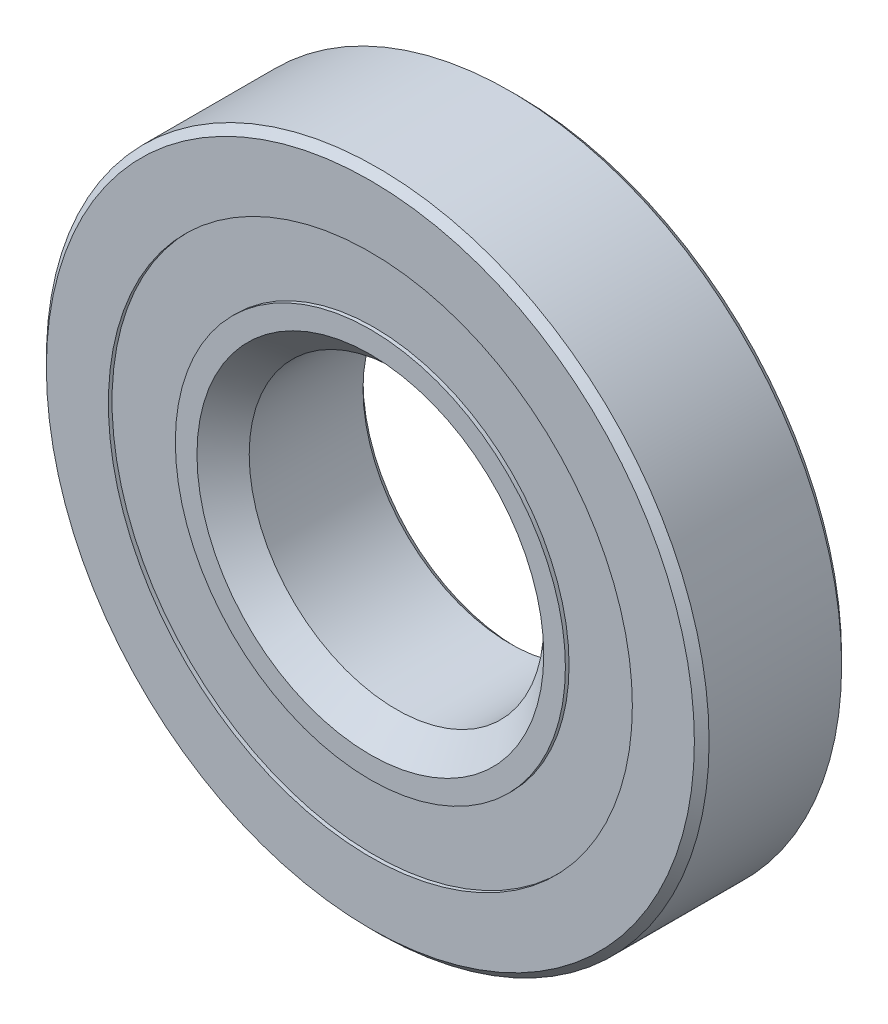
ISO-10303-21;
HEADER;
FILE_DESCRIPTION(('STEP AP214'),'2;1');
FILE_NAME('part.step','',(''),(''),'','','');
FILE_SCHEMA(('AUTOMOTIVE_DESIGN { 1 0 10303 214 1 1 1 1 }'));
ENDSEC;
DATA;
#1=APPLICATION_CONTEXT('core data for automotive mechanical design processes');
#2=APPLICATION_PROTOCOL_DEFINITION('international standard','automotive_design',2000,#1);
#3=PRODUCT_CONTEXT('',#1,'mechanical');
#4=PRODUCT('Part','Part','',(#3));
#5=PRODUCT_RELATED_PRODUCT_CATEGORY('part','',(#4));
#6=PRODUCT_DEFINITION_FORMATION('','',#4);
#7=PRODUCT_DEFINITION_CONTEXT('part definition',#1,'design');
#8=PRODUCT_DEFINITION('design','',#6,#7);
#9=PRODUCT_DEFINITION_SHAPE('','',#8);
#10=(LENGTH_UNIT() NAMED_UNIT(*) SI_UNIT(.MILLI.,.METRE.));
#11=(NAMED_UNIT(*) PLANE_ANGLE_UNIT() SI_UNIT($,.RADIAN.));
#12=(NAMED_UNIT(*) SI_UNIT($,.STERADIAN.) SOLID_ANGLE_UNIT());
#13=UNCERTAINTY_MEASURE_WITH_UNIT(LENGTH_MEASURE(1.E-05),#10,'distance_accuracy_value','');
#14=(GEOMETRIC_REPRESENTATION_CONTEXT(3) GLOBAL_UNCERTAINTY_ASSIGNED_CONTEXT((#13)) GLOBAL_UNIT_ASSIGNED_CONTEXT((#10,
#11,#12)) REPRESENTATION_CONTEXT('',''));
#15=CARTESIAN_POINT('',(0.,0.,0.));
#16=DIRECTION('',(0.,0.,1.));
#17=DIRECTION('',(1.,0.,0.));
#18=AXIS2_PLACEMENT_3D('',#15,#16,#17);
#19=CARTESIAN_POINT('',(0.,11.2956730769231,-3.01625));
#20=DIRECTION('',(0.,0.,1.));
#21=DIRECTION('',(1.,0.,0.));
#22=AXIS2_PLACEMENT_3D('',#19,#20,#21);
#23=PLANE('',#22);
#24=CARTESIAN_POINT('',(0.,0.,-3.01625));
#25=DIRECTION('',(0.,0.,1.));
#26=DIRECTION('',(1.,0.,0.));
#27=AXIS2_PLACEMENT_3D('',#24,#25,#26);
#28=CIRCLE('',#27,11.2956730769231);
#29=CARTESIAN_POINT('',(11.2956730769231,0.,-3.01625));
#30=VERTEX_POINT('',#29);
#31=EDGE_CURVE('E57',#30,#30,#28,.T.);
#32=ORIENTED_EDGE('',*,*,#31,.F.);
#33=EDGE_LOOP('',(#32));
#34=FACE_BOUND('',#33,.T.);
#35=CARTESIAN_POINT('',(0.,0.,-3.01625));
#36=DIRECTION('',(0.,0.,1.));
#37=DIRECTION('',(1.,0.,0.));
#38=AXIS2_PLACEMENT_3D('',#35,#36,#37);
#39=CIRCLE('',#38,8.40903123628057);
#40=CARTESIAN_POINT('',(8.40903123628057,0.,-3.01625));
#41=VERTEX_POINT('',#40);
#42=EDGE_CURVE('E11',#41,#41,#39,.T.);
#43=ORIENTED_EDGE('',*,*,#42,.T.);
#44=EDGE_LOOP('',(#43));
#45=FACE_BOUND('',#44,.T.);
#46=ADVANCED_FACE('F43',(#34,#45),#23,.F.);
#47=CARTESIAN_POINT('',(0.,0.,3.175));
#48=DIRECTION('',(0.,0.,1.));
#49=DIRECTION('',(1.,0.,0.));
#50=AXIS2_PLACEMENT_3D('',#47,#48,#49);
#51=CYLINDRICAL_SURFACE('',#50,8.40903123628057);
#52=ORIENTED_EDGE('',*,*,#42,.F.);
#53=EDGE_LOOP('',(#52));
#54=FACE_BOUND('',#53,.T.);
#55=CARTESIAN_POINT('',(0.,0.,-1.71627890103155));
#56=DIRECTION('',(0.,0.,1.));
#57=DIRECTION('',(1.,0.,0.));
#58=AXIS2_PLACEMENT_3D('',#55,#56,#57);
#59=CIRCLE('',#58,8.40903123628057);
#60=CARTESIAN_POINT('',(8.40903123628057,0.,-1.71627890103155));
#61=VERTEX_POINT('',#60);
#62=EDGE_CURVE('E49',#61,#61,#59,.T.);
#63=ORIENTED_EDGE('',*,*,#62,.T.);
#64=EDGE_LOOP('',(#63));
#65=FACE_BOUND('',#64,.T.);
#66=ADVANCED_FACE('F66',(#54,#65),#51,.F.);
#67=CARTESIAN_POINT('',(0.,11.2956730769231,-1.71627890103155));
#68=DIRECTION('',(0.,0.,-1.));
#69=DIRECTION('',(-1.,0.,0.));
#70=AXIS2_PLACEMENT_3D('',#67,#68,#69);
#71=PLANE('',#70);
#72=ORIENTED_EDGE('',*,*,#62,.F.);
#73=EDGE_LOOP('',(#72));
#74=FACE_BOUND('',#73,.T.);
#75=CARTESIAN_POINT('',(0.,0.,-1.71627890103155));
#76=DIRECTION('',(0.,0.,1.));
#77=DIRECTION('',(1.,0.,0.));
#78=AXIS2_PLACEMENT_3D('',#75,#76,#77);
#79=CIRCLE('',#78,11.2956730769231);
#80=CARTESIAN_POINT('',(11.2956730769231,0.,-1.71627890103155));
#81=VERTEX_POINT('',#80);
#82=EDGE_CURVE('E53',#81,#81,#79,.T.);
#83=ORIENTED_EDGE('',*,*,#82,.T.);
#84=EDGE_LOOP('',(#83));
#85=FACE_BOUND('',#84,.T.);
#86=ADVANCED_FACE('F70',(#74,#85),#71,.F.);
#87=CARTESIAN_POINT('',(0.,0.,3.175));
#88=DIRECTION('',(0.,0.,1.));
#89=DIRECTION('',(1.,0.,0.));
#90=AXIS2_PLACEMENT_3D('',#87,#88,#89);
#91=CYLINDRICAL_SURFACE('',#90,11.2956730769231);
#92=ORIENTED_EDGE('',*,*,#82,.F.);
#93=EDGE_LOOP('',(#92));
#94=FACE_BOUND('',#93,.T.);
#95=ORIENTED_EDGE('',*,*,#31,.T.);
#96=EDGE_LOOP('',(#95));
#97=FACE_BOUND('',#96,.T.);
#98=ADVANCED_FACE('F63',(#94,#97),#91,.T.);
#99=CLOSED_SHELL('',(#46,#66,#86,#98));
#100=MANIFOLD_SOLID_BREP('B2',#99);
#101=CARTESIAN_POINT('',(0.,11.2956730769231,3.01625));
#102=DIRECTION('',(0.,0.,-1.));
#103=DIRECTION('',(-1.,0.,0.));
#104=AXIS2_PLACEMENT_3D('',#101,#102,#103);
#105=PLANE('',#104);
#106=CARTESIAN_POINT('',(0.,0.,3.01625));
#107=DIRECTION('',(0.,0.,1.));
#108=DIRECTION('',(1.,0.,0.));
#109=AXIS2_PLACEMENT_3D('',#106,#107,#108);
#110=CIRCLE('',#109,8.40903123628057);
#111=CARTESIAN_POINT('',(8.40903123628057,0.,3.01625));
#112=VERTEX_POINT('',#111);
#113=EDGE_CURVE('E42',#112,#112,#110,.T.);
#114=ORIENTED_EDGE('',*,*,#113,.F.);
#115=EDGE_LOOP('',(#114));
#116=FACE_BOUND('',#115,.T.);
#117=CARTESIAN_POINT('',(0.,0.,3.01625));
#118=DIRECTION('',(0.,0.,1.));
#119=DIRECTION('',(1.,0.,0.));
#120=AXIS2_PLACEMENT_3D('',#117,#118,#119);
#121=CIRCLE('',#120,11.2956730769231);
#122=CARTESIAN_POINT('',(11.2956730769231,0.,3.01625));
#123=VERTEX_POINT('',#122);
#124=EDGE_CURVE('E124',#123,#123,#121,.T.);
#125=ORIENTED_EDGE('',*,*,#124,.T.);
#126=EDGE_LOOP('',(#125));
#127=FACE_BOUND('',#126,.T.);
#128=ADVANCED_FACE('F110',(#116,#127),#105,.F.);
#129=CARTESIAN_POINT('',(0.,0.,3.175));
#130=DIRECTION('',(0.,0.,1.));
#131=DIRECTION('',(1.,0.,0.));
#132=AXIS2_PLACEMENT_3D('',#129,#130,#131);
#133=CYLINDRICAL_SURFACE('',#132,8.40903123628057);
#134=CARTESIAN_POINT('',(0.,0.,1.71627890103156));
#135=DIRECTION('',(0.,0.,1.));
#136=DIRECTION('',(1.,0.,0.));
#137=AXIS2_PLACEMENT_3D('',#134,#135,#136);
#138=CIRCLE('',#137,8.40903123628057);
#139=CARTESIAN_POINT('',(8.40903123628057,0.,1.71627890103156));
#140=VERTEX_POINT('',#139);
#141=EDGE_CURVE('E116',#140,#140,#138,.T.);
#142=ORIENTED_EDGE('',*,*,#141,.F.);
#143=EDGE_LOOP('',(#142));
#144=FACE_BOUND('',#143,.T.);
#145=ORIENTED_EDGE('',*,*,#113,.T.);
#146=EDGE_LOOP('',(#145));
#147=FACE_BOUND('',#146,.T.);
#148=ADVANCED_FACE('F139',(#144,#147),#133,.F.);
#149=CARTESIAN_POINT('',(0.,11.2956730769231,1.71627890103156));
#150=DIRECTION('',(0.,0.,1.));
#151=DIRECTION('',(1.,0.,0.));
#152=AXIS2_PLACEMENT_3D('',#149,#150,#151);
#153=PLANE('',#152);
#154=CARTESIAN_POINT('',(0.,0.,1.71627890103156));
#155=DIRECTION('',(0.,0.,1.));
#156=DIRECTION('',(1.,0.,0.));
#157=AXIS2_PLACEMENT_3D('',#154,#155,#156);
#158=CIRCLE('',#157,11.2956730769231);
#159=CARTESIAN_POINT('',(11.2956730769231,0.,1.71627890103156));
#160=VERTEX_POINT('',#159);
#161=EDGE_CURVE('E120',#160,#160,#158,.T.);
#162=ORIENTED_EDGE('',*,*,#161,.F.);
#163=EDGE_LOOP('',(#162));
#164=FACE_BOUND('',#163,.T.);
#165=ORIENTED_EDGE('',*,*,#141,.T.);
#166=EDGE_LOOP('',(#165));
#167=FACE_BOUND('',#166,.T.);
#168=ADVANCED_FACE('F134',(#164,#167),#153,.F.);
#169=CARTESIAN_POINT('',(0.,0.,3.175));
#170=DIRECTION('',(0.,0.,1.));
#171=DIRECTION('',(1.,0.,0.));
#172=AXIS2_PLACEMENT_3D('',#169,#170,#171);
#173=CYLINDRICAL_SURFACE('',#172,11.2956730769231);
#174=ORIENTED_EDGE('',*,*,#124,.F.);
#175=EDGE_LOOP('',(#174));
#176=FACE_BOUND('',#175,.T.);
#177=ORIENTED_EDGE('',*,*,#161,.T.);
#178=EDGE_LOOP('',(#177));
#179=FACE_BOUND('',#178,.T.);
#180=ADVANCED_FACE('F131',(#176,#179),#173,.T.);
#181=CLOSED_SHELL('',(#128,#148,#168,#180));
#182=MANIFOLD_SOLID_BREP('B6',#181);
#183=CARTESIAN_POINT('',(-5.15937499999989,8.93629963530074,0.));
#184=DIRECTION('',(0.,0.,1.));
#185=DIRECTION('',(-0.499999999999989,0.866025403784445,0.));
#186=AXIS2_PLACEMENT_3D('',#183,#184,#185);
#187=SPHERICAL_SURFACE('',#186,1.71627890103156);
#188=CARTESIAN_POINT('',(-5.15937499999989,8.93629963530074,1.71627890103156));
#189=VERTEX_POINT('',#188);
#190=VERTEX_LOOP('',#189);
#191=FACE_BOUND('',#190,.T.);
#192=ADVANCED_FACE('F192',(#191),#187,.T.);
#193=CLOSED_SHELL('',(#192));
#194=MANIFOLD_SOLID_BREP('B37',#193);
#195=CARTESIAN_POINT('',(-8.93629963530062,5.1593750000001,0.));
#196=DIRECTION('',(0.,0.,1.));
#197=DIRECTION('',(-0.866025403784433,0.50000000000001,0.));
#198=AXIS2_PLACEMENT_3D('',#195,#196,#197);
#199=SPHERICAL_SURFACE('',#198,1.71627890103156);
#200=CARTESIAN_POINT('',(-8.93629963530062,5.1593750000001,1.71627890103156));
#201=VERTEX_POINT('',#200);
#202=VERTEX_LOOP('',#201);
#203=FACE_BOUND('',#202,.T.);
#204=ADVANCED_FACE('F225',(#203),#199,.T.);
#205=CLOSED_SHELL('',(#204));
#206=MANIFOLD_SOLID_BREP('B106',#205);
#207=CARTESIAN_POINT('',(-10.31875,1.08083169195563E-13,0.));
#208=DIRECTION('',(0.,0.,1.));
#209=DIRECTION('',(-1.,0.,0.));
#210=AXIS2_PLACEMENT_3D('',#207,#208,#209);
#211=SPHERICAL_SURFACE('',#210,1.71627890103156);
#212=CARTESIAN_POINT('',(-10.31875,1.08083169195563E-13,1.71627890103156));
#213=VERTEX_POINT('',#212);
#214=VERTEX_LOOP('',#213);
#215=FACE_BOUND('',#214,.T.);
#216=ADVANCED_FACE('F256',(#215),#211,.T.);
#217=CLOSED_SHELL('',(#216));
#218=MANIFOLD_SOLID_BREP('B188',#217);
#219=CARTESIAN_POINT('',(-8.93629963530072,-5.15937499999992,0.));
#220=DIRECTION('',(0.,0.,1.));
#221=DIRECTION('',(-0.866025403784443,-0.499999999999992,0.));
#222=AXIS2_PLACEMENT_3D('',#219,#220,#221);
#223=SPHERICAL_SURFACE('',#222,1.71627890103156);
#224=CARTESIAN_POINT('',(-8.93629963530072,-5.15937499999992,1.71627890103156));
#225=VERTEX_POINT('',#224);
#226=VERTEX_LOOP('',#225);
#227=FACE_BOUND('',#226,.T.);
#228=ADVANCED_FACE('F287',(#227),#223,.T.);
#229=CLOSED_SHELL('',(#228));
#230=MANIFOLD_SOLID_BREP('B221',#229);
#231=CARTESIAN_POINT('',(-5.15937500000007,-8.93629963530064,0.));
#232=DIRECTION('',(0.,0.,1.));
#233=DIRECTION('',(-0.500000000000007,-0.866025403784435,0.));
#234=AXIS2_PLACEMENT_3D('',#231,#232,#233);
#235=SPHERICAL_SURFACE('',#234,1.71627890103156);
#236=CARTESIAN_POINT('',(-5.15937500000007,-8.93629963530064,1.71627890103156));
#237=VERTEX_POINT('',#236);
#238=VERTEX_LOOP('',#237);
#239=FACE_BOUND('',#238,.T.);
#240=ADVANCED_FACE('F318',(#239),#235,.T.);
#241=CLOSED_SHELL('',(#240));
#242=MANIFOLD_SOLID_BREP('B252',#241);
#243=CARTESIAN_POINT('',(0.,-10.31875,0.));
#244=DIRECTION('',(0.,0.,1.));
#245=DIRECTION('',(0.,-1.,0.));
#246=AXIS2_PLACEMENT_3D('',#243,#244,#245);
#247=SPHERICAL_SURFACE('',#246,1.71627890103156);
#248=CARTESIAN_POINT('',(0.,-10.31875,1.71627890103156));
#249=VERTEX_POINT('',#248);
#250=VERTEX_LOOP('',#249);
#251=FACE_BOUND('',#250,.T.);
#252=ADVANCED_FACE('F351',(#251),#247,.T.);
#253=CLOSED_SHELL('',(#252));
#254=MANIFOLD_SOLID_BREP('B283',#253);
#255=CARTESIAN_POINT('',(5.15937499999995,-8.93629963530071,0.));
#256=DIRECTION('',(0.,0.,1.));
#257=DIRECTION('',(0.499999999999995,-0.866025403784442,0.));
#258=AXIS2_PLACEMENT_3D('',#255,#256,#257);
#259=SPHERICAL_SURFACE('',#258,1.71627890103156);
#260=CARTESIAN_POINT('',(5.15937499999995,-8.93629963530071,1.71627890103156));
#261=VERTEX_POINT('',#260);
#262=VERTEX_LOOP('',#261);
#263=FACE_BOUND('',#262,.T.);
#264=ADVANCED_FACE('F384',(#263),#259,.T.);
#265=CLOSED_SHELL('',(#264));
#266=MANIFOLD_SOLID_BREP('B314',#265);
#267=CARTESIAN_POINT('',(8.93629963530065,-5.15937500000004,0.));
#268=DIRECTION('',(0.,0.,1.));
#269=DIRECTION('',(0.866025403784436,-0.500000000000004,0.));
#270=AXIS2_PLACEMENT_3D('',#267,#268,#269);
#271=SPHERICAL_SURFACE('',#270,1.71627890103156);
#272=CARTESIAN_POINT('',(8.93629963530065,-5.15937500000004,1.71627890103156));
#273=VERTEX_POINT('',#272);
#274=VERTEX_LOOP('',#273);
#275=FACE_BOUND('',#274,.T.);
#276=ADVANCED_FACE('F417',(#275),#271,.T.);
#277=CLOSED_SHELL('',(#276));
#278=MANIFOLD_SOLID_BREP('B347',#277);
#279=CARTESIAN_POINT('',(10.31875,0.,0.));
#280=DIRECTION('',(0.,0.,1.));
#281=DIRECTION('',(1.,0.,0.));
#282=AXIS2_PLACEMENT_3D('',#279,#280,#281);
#283=SPHERICAL_SURFACE('',#282,1.71627890103156);
#284=CARTESIAN_POINT('',(10.31875,0.,1.71627890103156));
#285=VERTEX_POINT('',#284);
#286=VERTEX_LOOP('',#285);
#287=FACE_BOUND('',#286,.T.);
#288=ADVANCED_FACE('F450',(#287),#283,.T.);
#289=CLOSED_SHELL('',(#288));
#290=MANIFOLD_SOLID_BREP('B380',#289);
#291=CARTESIAN_POINT('',(8.93629963530069,5.15937499999998,0.));
#292=DIRECTION('',(0.,0.,1.));
#293=DIRECTION('',(0.86602540378444,0.499999999999998,0.));
#294=AXIS2_PLACEMENT_3D('',#291,#292,#293);
#295=SPHERICAL_SURFACE('',#294,1.71627890103156);
#296=CARTESIAN_POINT('',(8.93629963530069,5.15937499999998,1.71627890103156));
#297=VERTEX_POINT('',#296);
#298=VERTEX_LOOP('',#297);
#299=FACE_BOUND('',#298,.T.);
#300=ADVANCED_FACE('F483',(#299),#295,.T.);
#301=CLOSED_SHELL('',(#300));
#302=MANIFOLD_SOLID_BREP('B413',#301);
#303=CARTESIAN_POINT('',(5.15937500000001,8.93629963530067,0.));
#304=DIRECTION('',(0.,0.,1.));
#305=DIRECTION('',(0.500000000000001,0.866025403784438,0.));
#306=AXIS2_PLACEMENT_3D('',#303,#304,#305);
#307=SPHERICAL_SURFACE('',#306,1.71627890103156);
#308=CARTESIAN_POINT('',(5.15937500000001,8.93629963530067,1.71627890103156));
#309=VERTEX_POINT('',#308);
#310=VERTEX_LOOP('',#309);
#311=FACE_BOUND('',#310,.T.);
#312=ADVANCED_FACE('F516',(#311),#307,.T.);
#313=CLOSED_SHELL('',(#312));
#314=MANIFOLD_SOLID_BREP('B446',#313);
#315=CARTESIAN_POINT('',(0.,10.31875,0.));
#316=DIRECTION('',(0.,0.,1.));
#317=DIRECTION('',(0.,1.,0.));
#318=AXIS2_PLACEMENT_3D('',#315,#316,#317);
#319=SPHERICAL_SURFACE('',#318,1.71627890103156);
#320=CARTESIAN_POINT('',(0.,10.31875,1.71627890103156));
#321=VERTEX_POINT('',#320);
#322=VERTEX_LOOP('',#321);
#323=FACE_BOUND('',#322,.T.);
#324=ADVANCED_FACE('F551',(#323),#319,.T.);
#325=CLOSED_SHELL('',(#324));
#326=MANIFOLD_SOLID_BREP('B479',#325);
#327=CARTESIAN_POINT('',(0.,0.,3.175));
#328=DIRECTION('',(0.,0.,1.));
#329=DIRECTION('',(1.,0.,0.));
#330=AXIS2_PLACEMENT_3D('',#327,#328,#329);
#331=CYLINDRICAL_SURFACE('',#330,8.40903123628057);
#332=CARTESIAN_POINT('',(0.,0.,3.175));
#333=DIRECTION('',(0.,0.,1.));
#334=DIRECTION('',(1.,0.,0.));
#335=AXIS2_PLACEMENT_3D('',#332,#333,#334);
#336=CIRCLE('',#335,8.40903123628057);
#337=CARTESIAN_POINT('',(8.40903123628057,0.,3.175));
#338=VERTEX_POINT('',#337);
#339=EDGE_CURVE('E610',#338,#338,#336,.T.);
#340=ORIENTED_EDGE('',*,*,#339,.F.);
#341=EDGE_LOOP('',(#340));
#342=FACE_BOUND('',#341,.T.);
#343=CARTESIAN_POINT('',(0.,0.,3.01625));
#344=DIRECTION('',(0.,0.,1.));
#345=DIRECTION('',(1.,0.,0.));
#346=AXIS2_PLACEMENT_3D('',#343,#344,#345);
#347=CIRCLE('',#346,8.40903123628057);
#348=CARTESIAN_POINT('',(8.40903123628057,0.,3.01625));
#349=VERTEX_POINT('',#348);
#350=EDGE_CURVE('E550',#349,#349,#347,.T.);
#351=ORIENTED_EDGE('',*,*,#350,.T.);
#352=EDGE_LOOP('',(#351));
#353=FACE_BOUND('',#352,.T.);
#354=ADVANCED_FACE('F570',(#342,#353),#331,.T.);
#355=CARTESIAN_POINT('',(0.,8.40903123628057,3.01625));
#356=DIRECTION('',(0.,0.,1.));
#357=DIRECTION('',(1.,0.,0.));
#358=AXIS2_PLACEMENT_3D('',#355,#356,#357);
#359=PLANE('',#358);
#360=ORIENTED_EDGE('',*,*,#350,.F.);
#361=EDGE_LOOP('',(#360));
#362=FACE_BOUND('',#361,.T.);
#363=CARTESIAN_POINT('',(0.,0.,3.01625));
#364=DIRECTION('',(0.,0.,1.));
#365=DIRECTION('',(1.,0.,0.));
#366=AXIS2_PLACEMENT_3D('',#363,#364,#365);
#367=CIRCLE('',#366,8.25028123628057);
#368=CARTESIAN_POINT('',(8.25028123628057,0.,3.01625));
#369=VERTEX_POINT('',#368);
#370=EDGE_CURVE('E576',#369,#369,#367,.T.);
#371=ORIENTED_EDGE('',*,*,#370,.T.);
#372=EDGE_LOOP('',(#371));
#373=FACE_BOUND('',#372,.T.);
#374=ADVANCED_FACE('F617',(#362,#373),#359,.F.);
#375=CARTESIAN_POINT('',(0.,0.,2.24220431320366));
#376=DIRECTION('',(0.,0.,1.));
#377=DIRECTION('',(1.,0.,0.));
#378=AXIS2_PLACEMENT_3D('',#375,#376,#377);
#379=CONICAL_SURFACE('',#378,7.47623554948422,0.785398163397449);
#380=ORIENTED_EDGE('',*,*,#370,.F.);
#381=EDGE_LOOP('',(#380));
#382=FACE_BOUND('',#381,.T.);
#383=CARTESIAN_POINT('',(0.,0.,2.24220431320366));
#384=DIRECTION('',(0.,0.,1.));
#385=DIRECTION('',(1.,0.,0.));
#386=AXIS2_PLACEMENT_3D('',#383,#384,#385);
#387=CIRCLE('',#386,7.47623554948422);
#388=CARTESIAN_POINT('',(7.47623554948422,0.,2.24220431320366));
#389=VERTEX_POINT('',#388);
#390=EDGE_CURVE('E580',#389,#389,#387,.T.);
#391=ORIENTED_EDGE('',*,*,#390,.T.);
#392=EDGE_LOOP('',(#391));
#393=FACE_BOUND('',#392,.T.);
#394=ADVANCED_FACE('F621',(#382,#393),#379,.T.);
#395=CARTESIAN_POINT('',(0.,0.,3.175));
#396=DIRECTION('',(0.,0.,1.));
#397=DIRECTION('',(1.,0.,0.));
#398=AXIS2_PLACEMENT_3D('',#395,#396,#397);
#399=CYLINDRICAL_SURFACE('',#398,7.47623554948422);
#400=ORIENTED_EDGE('',*,*,#390,.F.);
#401=EDGE_LOOP('',(#400));
#402=FACE_BOUND('',#401,.T.);
#403=CARTESIAN_POINT('',(0.,0.,0.));
#404=DIRECTION('',(0.,0.,1.));
#405=DIRECTION('',(1.,0.,0.));
#406=AXIS2_PLACEMENT_3D('',#403,#404,#405);
#407=CIRCLE('',#406,7.47623554948422);
#408=CARTESIAN_POINT('',(7.47623554948422,0.,0.));
#409=VERTEX_POINT('',#408);
#410=EDGE_CURVE('E584',#409,#409,#407,.T.);
#411=ORIENTED_EDGE('',*,*,#410,.T.);
#412=EDGE_LOOP('',(#411));
#413=FACE_BOUND('',#412,.T.);
#414=ADVANCED_FACE('F626',(#402,#413),#399,.T.);
#415=CARTESIAN_POINT('',(0.,7.47623554948422,0.));
#416=DIRECTION('',(0.,0.,-1.));
#417=DIRECTION('',(-1.,0.,0.));
#418=AXIS2_PLACEMENT_3D('',#415,#416,#417);
#419=PLANE('',#418);
#420=ORIENTED_EDGE('',*,*,#410,.F.);
#421=EDGE_LOOP('',(#420));
#422=FACE_BOUND('',#421,.T.);
#423=CARTESIAN_POINT('',(0.,0.,0.));
#424=DIRECTION('',(0.,0.,1.));
#425=DIRECTION('',(1.,0.,0.));
#426=AXIS2_PLACEMENT_3D('',#423,#424,#425);
#427=CIRCLE('',#426,8.60247109896845);
#428=CARTESIAN_POINT('',(8.60247109896845,0.,0.));
#429=VERTEX_POINT('',#428);
#430=EDGE_CURVE('E589',#429,#429,#427,.T.);
#431=ORIENTED_EDGE('',*,*,#430,.T.);
#432=EDGE_LOOP('',(#431));
#433=FACE_BOUND('',#432,.T.);
#434=ADVANCED_FACE('F632',(#422,#433),#419,.F.);
#435=CARTESIAN_POINT('',(0.,0.,0.));
#436=DIRECTION('',(0.,0.,1.));
#437=DIRECTION('',(1.,0.,0.));
#438=AXIS2_PLACEMENT_3D('',#435,#436,#437);
#439=TOROIDAL_SURFACE('',#438,10.31875,1.71627890103156);
#440=ORIENTED_EDGE('',*,*,#430,.F.);
#441=EDGE_LOOP('',(#440));
#442=FACE_BOUND('',#441,.T.);
#443=CARTESIAN_POINT('',(0.,0.,-1.41111111111111));
#444=DIRECTION('',(0.,0.,1.));
#445=DIRECTION('',(1.,0.,0.));
#446=AXIS2_PLACEMENT_3D('',#443,#444,#445);
#447=CIRCLE('',#446,9.34182692307692);
#448=CARTESIAN_POINT('',(9.34182692307692,0.,-1.41111111111111));
#449=VERTEX_POINT('',#448);
#450=EDGE_CURVE('E592',#449,#449,#447,.T.);
#451=ORIENTED_EDGE('',*,*,#450,.T.);
#452=EDGE_LOOP('',(#451));
#453=FACE_BOUND('',#452,.T.);
#454=ADVANCED_FACE('F636',(#442,#453),#439,.F.);
#455=CARTESIAN_POINT('',(0.,0.,3.175));
#456=DIRECTION('',(0.,0.,1.));
#457=DIRECTION('',(1.,0.,0.));
#458=AXIS2_PLACEMENT_3D('',#455,#456,#457);
#459=CYLINDRICAL_SURFACE('',#458,9.34182692307692);
#460=ORIENTED_EDGE('',*,*,#450,.F.);
#461=EDGE_LOOP('',(#460));
#462=FACE_BOUND('',#461,.T.);
#463=CARTESIAN_POINT('',(0.,0.,-3.175));
#464=DIRECTION('',(0.,0.,1.));
#465=DIRECTION('',(1.,0.,0.));
#466=AXIS2_PLACEMENT_3D('',#463,#464,#465);
#467=CIRCLE('',#466,9.34182692307692);
#468=CARTESIAN_POINT('',(9.34182692307692,0.,-3.175));
#469=VERTEX_POINT('',#468);
#470=EDGE_CURVE('E595',#469,#469,#467,.T.);
#471=ORIENTED_EDGE('',*,*,#470,.T.);
#472=EDGE_LOOP('',(#471));
#473=FACE_BOUND('',#472,.T.);
#474=ADVANCED_FACE('F640',(#462,#473),#459,.T.);
#475=CARTESIAN_POINT('',(0.,6.6675,-3.175));
#476=DIRECTION('',(0.,0.,1.));
#477=DIRECTION('',(1.,0.,0.));
#478=AXIS2_PLACEMENT_3D('',#475,#476,#477);
#479=PLANE('',#478);
#480=ORIENTED_EDGE('',*,*,#470,.F.);
#481=EDGE_LOOP('',(#480));
#482=FACE_BOUND('',#481,.T.);
#483=CARTESIAN_POINT('',(0.,0.,-3.175));
#484=DIRECTION('',(0.,0.,1.));
#485=DIRECTION('',(1.,0.,0.));
#486=AXIS2_PLACEMENT_3D('',#483,#484,#485);
#487=CIRCLE('',#486,6.6675);
#488=CARTESIAN_POINT('',(6.6675,0.,-3.175));
#489=VERTEX_POINT('',#488);
#490=EDGE_CURVE('E598',#489,#489,#487,.T.);
#491=ORIENTED_EDGE('',*,*,#490,.T.);
#492=EDGE_LOOP('',(#491));
#493=FACE_BOUND('',#492,.T.);
#494=ADVANCED_FACE('F644',(#482,#493),#479,.F.);
#495=CARTESIAN_POINT('',(0.,0.,-2.8575));
#496=DIRECTION('',(0.,0.,-1.));
#497=DIRECTION('',(-1.,0.,0.));
#498=AXIS2_PLACEMENT_3D('',#495,#496,#497);
#499=CONICAL_SURFACE('',#498,6.35,0.785398163397447);
#500=ORIENTED_EDGE('',*,*,#490,.F.);
#501=EDGE_LOOP('',(#500));
#502=FACE_BOUND('',#501,.T.);
#503=CARTESIAN_POINT('',(0.,0.,-2.8575));
#504=DIRECTION('',(0.,0.,1.));
#505=DIRECTION('',(1.,0.,0.));
#506=AXIS2_PLACEMENT_3D('',#503,#504,#505);
#507=CIRCLE('',#506,6.35);
#508=CARTESIAN_POINT('',(6.35,0.,-2.8575));
#509=VERTEX_POINT('',#508);
#510=EDGE_CURVE('E601',#509,#509,#507,.T.);
#511=ORIENTED_EDGE('',*,*,#510,.T.);
#512=EDGE_LOOP('',(#511));
#513=FACE_BOUND('',#512,.T.);
#514=ADVANCED_FACE('F648',(#502,#513),#499,.F.);
#515=CARTESIAN_POINT('',(0.,0.,3.175));
#516=DIRECTION('',(0.,0.,1.));
#517=DIRECTION('',(1.,0.,0.));
#518=AXIS2_PLACEMENT_3D('',#515,#516,#517);
#519=CYLINDRICAL_SURFACE('',#518,6.35);
#520=ORIENTED_EDGE('',*,*,#510,.F.);
#521=EDGE_LOOP('',(#520));
#522=FACE_BOUND('',#521,.T.);
#523=CARTESIAN_POINT('',(0.,0.,2.04876445051578));
#524=DIRECTION('',(0.,0.,1.));
#525=DIRECTION('',(1.,0.,0.));
#526=AXIS2_PLACEMENT_3D('',#523,#524,#525);
#527=CIRCLE('',#526,6.35);
#528=CARTESIAN_POINT('',(6.35,0.,2.04876445051578));
#529=VERTEX_POINT('',#528);
#530=EDGE_CURVE('E604',#529,#529,#527,.T.);
#531=ORIENTED_EDGE('',*,*,#530,.T.);
#532=EDGE_LOOP('',(#531));
#533=FACE_BOUND('',#532,.T.);
#534=ADVANCED_FACE('F652',(#522,#533),#519,.F.);
#535=CARTESIAN_POINT('',(0.,0.,3.175));
#536=DIRECTION('',(0.,0.,1.));
#537=DIRECTION('',(1.,0.,0.));
#538=AXIS2_PLACEMENT_3D('',#535,#536,#537);
#539=CONICAL_SURFACE('',#538,7.47623554948422,0.785398163397449);
#540=ORIENTED_EDGE('',*,*,#530,.F.);
#541=EDGE_LOOP('',(#540));
#542=FACE_BOUND('',#541,.T.);
#543=CARTESIAN_POINT('',(0.,0.,3.175));
#544=DIRECTION('',(0.,0.,1.));
#545=DIRECTION('',(1.,0.,0.));
#546=AXIS2_PLACEMENT_3D('',#543,#544,#545);
#547=CIRCLE('',#546,7.47623554948422);
#548=CARTESIAN_POINT('',(7.47623554948422,0.,3.175));
#549=VERTEX_POINT('',#548);
#550=EDGE_CURVE('E607',#549,#549,#547,.T.);
#551=ORIENTED_EDGE('',*,*,#550,.T.);
#552=EDGE_LOOP('',(#551));
#553=FACE_BOUND('',#552,.T.);
#554=ADVANCED_FACE('F656',(#542,#553),#539,.F.);
#555=CARTESIAN_POINT('',(0.,8.40903123628057,3.175));
#556=DIRECTION('',(0.,0.,-1.));
#557=DIRECTION('',(-1.,0.,0.));
#558=AXIS2_PLACEMENT_3D('',#555,#556,#557);
#559=PLANE('',#558);
#560=ORIENTED_EDGE('',*,*,#550,.F.);
#561=EDGE_LOOP('',(#560));
#562=FACE_BOUND('',#561,.T.);
#563=ORIENTED_EDGE('',*,*,#339,.T.);
#564=EDGE_LOOP('',(#563));
#565=FACE_BOUND('',#564,.T.);
#566=ADVANCED_FACE('F614',(#562,#565),#559,.F.);
#567=CLOSED_SHELL('',(#354,#374,#394,#414,#434,#454,#474,#494,#514,#534,#554,#566));
#568=MANIFOLD_SOLID_BREP('B512',#567);
#569=CARTESIAN_POINT('',(0.,0.,2.8575));
#570=DIRECTION('',(0.,0.,-1.));
#571=DIRECTION('',(-1.,0.,0.));
#572=AXIS2_PLACEMENT_3D('',#569,#570,#571);
#573=CONICAL_SURFACE('',#572,14.2875,0.785398163397446);
#574=CARTESIAN_POINT('',(0.,0.,3.175));
#575=DIRECTION('',(0.,0.,1.));
#576=DIRECTION('',(1.,0.,0.));
#577=AXIS2_PLACEMENT_3D('',#574,#575,#576);
#578=CIRCLE('',#577,13.97);
#579=CARTESIAN_POINT('',(13.97,0.,3.175));
#580=VERTEX_POINT('',#579);
#581=EDGE_CURVE('E779',#580,#580,#578,.T.);
#582=ORIENTED_EDGE('',*,*,#581,.F.);
#583=EDGE_LOOP('',(#582));
#584=FACE_BOUND('',#583,.T.);
#585=CARTESIAN_POINT('',(0.,0.,2.8575));
#586=DIRECTION('',(0.,0.,1.));
#587=DIRECTION('',(1.,0.,0.));
#588=AXIS2_PLACEMENT_3D('',#585,#586,#587);
#589=CIRCLE('',#588,14.2875);
#590=CARTESIAN_POINT('',(14.2875,0.,2.8575));
#591=VERTEX_POINT('',#590);
#592=EDGE_CURVE('E569',#591,#591,#589,.T.);
#593=ORIENTED_EDGE('',*,*,#592,.T.);
#594=EDGE_LOOP('',(#593));
#595=FACE_BOUND('',#594,.T.);
#596=ADVANCED_FACE('F751',(#584,#595),#573,.T.);
#597=CARTESIAN_POINT('',(0.,0.,3.175));
#598=DIRECTION('',(0.,0.,1.));
#599=DIRECTION('',(1.,0.,0.));
#600=AXIS2_PLACEMENT_3D('',#597,#598,#599);
#601=CYLINDRICAL_SURFACE('',#600,14.2875);
#602=ORIENTED_EDGE('',*,*,#592,.F.);
#603=EDGE_LOOP('',(#602));
#604=FACE_BOUND('',#603,.T.);
#605=CARTESIAN_POINT('',(0.,0.,-2.8575));
#606=DIRECTION('',(0.,0.,1.));
#607=DIRECTION('',(1.,0.,0.));
#608=AXIS2_PLACEMENT_3D('',#605,#606,#607);
#609=CIRCLE('',#608,14.2875);
#610=CARTESIAN_POINT('',(14.2875,0.,-2.8575));
#611=VERTEX_POINT('',#610);
#612=EDGE_CURVE('E757',#611,#611,#609,.T.);
#613=ORIENTED_EDGE('',*,*,#612,.T.);
#614=EDGE_LOOP('',(#613));
#615=FACE_BOUND('',#614,.T.);
#616=ADVANCED_FACE('F786',(#604,#615),#601,.T.);
#617=CARTESIAN_POINT('',(0.,0.,-3.175));
#618=DIRECTION('',(0.,0.,1.));
#619=DIRECTION('',(1.,0.,0.));
#620=AXIS2_PLACEMENT_3D('',#617,#618,#619);
#621=CONICAL_SURFACE('',#620,13.97,0.785398163397446);
#622=ORIENTED_EDGE('',*,*,#612,.F.);
#623=EDGE_LOOP('',(#622));
#624=FACE_BOUND('',#623,.T.);
#625=CARTESIAN_POINT('',(0.,0.,-3.175));
#626=DIRECTION('',(0.,0.,1.));
#627=DIRECTION('',(1.,0.,0.));
#628=AXIS2_PLACEMENT_3D('',#625,#626,#627);
#629=CIRCLE('',#628,13.97);
#630=CARTESIAN_POINT('',(13.97,0.,-3.175));
#631=VERTEX_POINT('',#630);
#632=EDGE_CURVE('E761',#631,#631,#629,.T.);
#633=ORIENTED_EDGE('',*,*,#632,.T.);
#634=EDGE_LOOP('',(#633));
#635=FACE_BOUND('',#634,.T.);
#636=ADVANCED_FACE('F790',(#624,#635),#621,.T.);
#637=CARTESIAN_POINT('',(0.,13.97,-3.175));
#638=DIRECTION('',(0.,0.,1.));
#639=DIRECTION('',(1.,0.,0.));
#640=AXIS2_PLACEMENT_3D('',#637,#638,#639);
#641=PLANE('',#640);
#642=ORIENTED_EDGE('',*,*,#632,.F.);
#643=EDGE_LOOP('',(#642));
#644=FACE_BOUND('',#643,.T.);
#645=CARTESIAN_POINT('',(0.,0.,-3.175));
#646=DIRECTION('',(0.,0.,1.));
#647=DIRECTION('',(1.,0.,0.));
#648=AXIS2_PLACEMENT_3D('',#645,#646,#647);
#649=CIRCLE('',#648,11.2956730769231);
#650=CARTESIAN_POINT('',(11.2956730769231,0.,-3.175));
#651=VERTEX_POINT('',#650);
#652=EDGE_CURVE('E765',#651,#651,#649,.T.);
#653=ORIENTED_EDGE('',*,*,#652,.T.);
#654=EDGE_LOOP('',(#653));
#655=FACE_BOUND('',#654,.T.);
#656=ADVANCED_FACE('F795',(#644,#655),#641,.F.);
#657=CARTESIAN_POINT('',(0.,0.,3.175));
#658=DIRECTION('',(0.,0.,1.));
#659=DIRECTION('',(1.,0.,0.));
#660=AXIS2_PLACEMENT_3D('',#657,#658,#659);
#661=CYLINDRICAL_SURFACE('',#660,11.2956730769231);
#662=ORIENTED_EDGE('',*,*,#652,.F.);
#663=EDGE_LOOP('',(#662));
#664=FACE_BOUND('',#663,.T.);
#665=CARTESIAN_POINT('',(0.,0.,-1.41111111111111));
#666=DIRECTION('',(0.,0.,1.));
#667=DIRECTION('',(1.,0.,0.));
#668=AXIS2_PLACEMENT_3D('',#665,#666,#667);
#669=CIRCLE('',#668,11.2956730769231);
#670=CARTESIAN_POINT('',(11.2956730769231,0.,-1.41111111111111));
#671=VERTEX_POINT('',#670);
#672=EDGE_CURVE('E770',#671,#671,#669,.T.);
#673=ORIENTED_EDGE('',*,*,#672,.T.);
#674=EDGE_LOOP('',(#673));
#675=FACE_BOUND('',#674,.T.);
#676=ADVANCED_FACE('F801',(#664,#675),#661,.F.);
#677=CARTESIAN_POINT('',(0.,0.,0.));
#678=DIRECTION('',(0.,0.,1.));
#679=DIRECTION('',(1.,0.,0.));
#680=AXIS2_PLACEMENT_3D('',#677,#678,#679);
#681=TOROIDAL_SURFACE('',#680,10.31875,1.71627890103156);
#682=ORIENTED_EDGE('',*,*,#672,.F.);
#683=EDGE_LOOP('',(#682));
#684=FACE_BOUND('',#683,.T.);
#685=CARTESIAN_POINT('',(0.,0.,1.41111111111111));
#686=DIRECTION('',(0.,0.,1.));
#687=DIRECTION('',(1.,0.,0.));
#688=AXIS2_PLACEMENT_3D('',#685,#686,#687);
#689=CIRCLE('',#688,11.2956730769231);
#690=CARTESIAN_POINT('',(11.2956730769231,0.,1.41111111111111));
#691=VERTEX_POINT('',#690);
#692=EDGE_CURVE('E773',#691,#691,#689,.T.);
#693=ORIENTED_EDGE('',*,*,#692,.T.);
#694=EDGE_LOOP('',(#693));
#695=FACE_BOUND('',#694,.T.);
#696=ADVANCED_FACE('F805',(#684,#695),#681,.F.);
#697=CARTESIAN_POINT('',(0.,0.,3.175));
#698=DIRECTION('',(0.,0.,1.));
#699=DIRECTION('',(1.,0.,0.));
#700=AXIS2_PLACEMENT_3D('',#697,#698,#699);
#701=CYLINDRICAL_SURFACE('',#700,11.2956730769231);
#702=ORIENTED_EDGE('',*,*,#692,.F.);
#703=EDGE_LOOP('',(#702));
#704=FACE_BOUND('',#703,.T.);
#705=CARTESIAN_POINT('',(0.,0.,3.175));
#706=DIRECTION('',(0.,0.,1.));
#707=DIRECTION('',(1.,0.,0.));
#708=AXIS2_PLACEMENT_3D('',#705,#706,#707);
#709=CIRCLE('',#708,11.2956730769231);
#710=CARTESIAN_POINT('',(11.2956730769231,0.,3.175));
#711=VERTEX_POINT('',#710);
#712=EDGE_CURVE('E776',#711,#711,#709,.T.);
#713=ORIENTED_EDGE('',*,*,#712,.T.);
#714=EDGE_LOOP('',(#713));
#715=FACE_BOUND('',#714,.T.);
#716=ADVANCED_FACE('F809',(#704,#715),#701,.F.);
#717=CARTESIAN_POINT('',(0.,13.97,3.175));
#718=DIRECTION('',(0.,0.,-1.));
#719=DIRECTION('',(-1.,0.,0.));
#720=AXIS2_PLACEMENT_3D('',#717,#718,#719);
#721=PLANE('',#720);
#722=ORIENTED_EDGE('',*,*,#712,.F.);
#723=EDGE_LOOP('',(#722));
#724=FACE_BOUND('',#723,.T.);
#725=ORIENTED_EDGE('',*,*,#581,.T.);
#726=EDGE_LOOP('',(#725));
#727=FACE_BOUND('',#726,.T.);
#728=ADVANCED_FACE('F783',(#724,#727),#721,.F.);
#729=CLOSED_SHELL('',(#596,#616,#636,#656,#676,#696,#716,#728));
#730=MANIFOLD_SOLID_BREP('B545',#729);
#731=ADVANCED_BREP_SHAPE_REPRESENTATION('',(#18,#100,#182,#194,#206,#218,#230,#242,#254,#266,
#278,#290,#302,#314,#326,#568,#730),#14);
#732=SHAPE_DEFINITION_REPRESENTATION(#9,#731);
ENDSEC;
END-ISO-10303-21;
